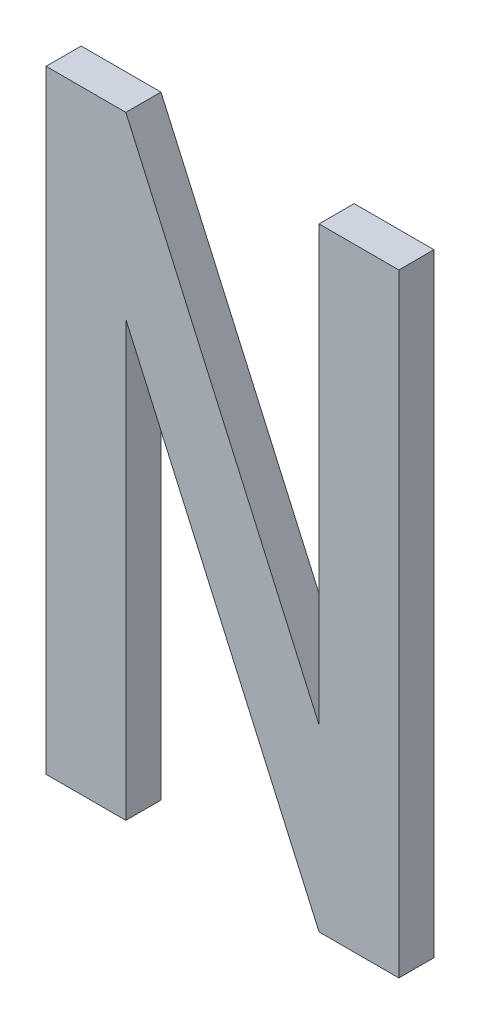
ISO-10303-21;
HEADER;
FILE_DESCRIPTION(('STEP AP214'),'2;1');
FILE_NAME('part.step','',(''),(''),'','','');
FILE_SCHEMA(('AUTOMOTIVE_DESIGN { 1 0 10303 214 1 1 1 1 }'));
ENDSEC;
DATA;
#1=APPLICATION_CONTEXT('core data for automotive mechanical design processes');
#2=APPLICATION_PROTOCOL_DEFINITION('international standard','automotive_design',2000,#1);
#3=PRODUCT_CONTEXT('',#1,'mechanical');
#4=PRODUCT('Part','Part','',(#3));
#5=PRODUCT_RELATED_PRODUCT_CATEGORY('part','',(#4));
#6=PRODUCT_DEFINITION_FORMATION('','',#4);
#7=PRODUCT_DEFINITION_CONTEXT('part definition',#1,'design');
#8=PRODUCT_DEFINITION('design','',#6,#7);
#9=PRODUCT_DEFINITION_SHAPE('','',#8);
#10=(LENGTH_UNIT() NAMED_UNIT(*) SI_UNIT(.MILLI.,.METRE.));
#11=(NAMED_UNIT(*) PLANE_ANGLE_UNIT() SI_UNIT($,.RADIAN.));
#12=(NAMED_UNIT(*) SI_UNIT($,.STERADIAN.) SOLID_ANGLE_UNIT());
#13=UNCERTAINTY_MEASURE_WITH_UNIT(LENGTH_MEASURE(1.E-05),#10,'distance_accuracy_value','');
#14=(GEOMETRIC_REPRESENTATION_CONTEXT(3) GLOBAL_UNCERTAINTY_ASSIGNED_CONTEXT((#13)) GLOBAL_UNIT_ASSIGNED_CONTEXT((#10,
#11,#12)) REPRESENTATION_CONTEXT('',''));
#15=CARTESIAN_POINT('',(0.,0.,0.));
#16=DIRECTION('',(0.,0.,1.));
#17=DIRECTION('',(1.,0.,0.));
#18=AXIS2_PLACEMENT_3D('',#15,#16,#17);
#19=CARTESIAN_POINT('',(-0.229064699613517,-0.0761015964274146,0.000499999999999999));
#20=DIRECTION('',(0.913553330450716,0.406718959998677,0.));
#21=DIRECTION('',(0.406718959998677,-0.913553330450716,0.));
#22=AXIS2_PLACEMENT_3D('',#19,#20,#21);
#23=PLANE('',#22);
#24=DIRECTION('',(0.,0.,1.));
#25=VECTOR('',#24,1.);
#26=CARTESIAN_POINT('',(-0.223560426585753,-0.0884650401091166,0.00025));
#27=LINE('',#26,#25);
#28=CARTESIAN_POINT('',(-0.223560426585753,-0.0884650401091163,-0.000499999999999999));
#29=VERTEX_POINT('',#28);
#30=CARTESIAN_POINT('',(-0.223560426585753,-0.0884650401091163,0.000499999999999999));
#31=VERTEX_POINT('',#30);
#32=EDGE_CURVE('E11',#29,#31,#27,.T.);
#33=ORIENTED_EDGE('',*,*,#32,.F.);
#34=DIRECTION('',(0.406718959998677,-0.913553330450716,0.));
#35=VECTOR('',#34,1.);
#36=CARTESIAN_POINT('',(-0.221286922509068,-0.0935716798906888,-0.000499999999999999));
#37=LINE('',#36,#35);
#38=CARTESIAN_POINT('',(-0.229064699613517,-0.0761015964274146,-0.000499999999999999));
#39=VERTEX_POINT('',#38);
#40=EDGE_CURVE('E24',#39,#29,#37,.T.);
#41=ORIENTED_EDGE('',*,*,#40,.F.);
#42=DIRECTION('',(0.,0.,1.));
#43=VECTOR('',#42,1.);
#44=CARTESIAN_POINT('',(-0.229064699613517,-0.0761015964274146,0.));
#45=LINE('',#44,#43);
#46=CARTESIAN_POINT('',(-0.229064699613517,-0.0761015964274146,0.000499999999999999));
#47=VERTEX_POINT('',#46);
#48=EDGE_CURVE('E175',#39,#47,#45,.T.);
#49=ORIENTED_EDGE('',*,*,#48,.T.);
#50=DIRECTION('',(-0.406718959998677,0.913553330450716,0.));
#51=VECTOR('',#50,1.);
#52=CARTESIAN_POINT('',(-0.221286922509068,-0.0935716798906888,0.000499999999999999));
#53=LINE('',#52,#51);
#54=EDGE_CURVE('E113',#31,#47,#53,.T.);
#55=ORIENTED_EDGE('',*,*,#54,.F.);
#56=EDGE_LOOP('',(#33,#41,#49,#55));
#57=FACE_BOUND('',#56,.T.);
#58=ADVANCED_FACE('F17',(#57),#23,.T.);
#59=CARTESIAN_POINT('',(-0.223560426585753,-0.0935716798906888,0.000499999999999999));
#60=DIRECTION('',(-0.913553330450716,-0.406718959998677,0.));
#61=DIRECTION('',(-0.406718959998677,0.913553330450716,0.));
#62=AXIS2_PLACEMENT_3D('',#59,#60,#61);
#63=PLANE('',#62);
#64=DIRECTION('',(0.,0.,1.));
#65=VECTOR('',#64,1.);
#66=CARTESIAN_POINT('',(-0.229064699613517,-0.0812082362089871,0.00025));
#67=LINE('',#66,#65);
#68=CARTESIAN_POINT('',(-0.229064699613517,-0.0812082362089871,-0.000499999999999999));
#69=VERTEX_POINT('',#68);
#70=CARTESIAN_POINT('',(-0.229064699613517,-0.0812082362089871,0.000499999999999999));
#71=VERTEX_POINT('',#70);
#72=EDGE_CURVE('E172',#69,#71,#67,.T.);
#73=ORIENTED_EDGE('',*,*,#72,.F.);
#74=DIRECTION('',(-0.406718959998677,0.913553330450716,0.));
#75=VECTOR('',#74,1.);
#76=CARTESIAN_POINT('',(-0.231338203690202,-0.0761015964274146,-0.000499999999999999));
#77=LINE('',#76,#75);
#78=CARTESIAN_POINT('',(-0.223560426585753,-0.0935716798906888,-0.000499999999999999));
#79=VERTEX_POINT('',#78);
#80=EDGE_CURVE('E169',#79,#69,#77,.T.);
#81=ORIENTED_EDGE('',*,*,#80,.F.);
#82=DIRECTION('',(0.,0.,1.));
#83=VECTOR('',#82,1.);
#84=CARTESIAN_POINT('',(-0.223560426585753,-0.0935716798906888,0.));
#85=LINE('',#84,#83);
#86=CARTESIAN_POINT('',(-0.223560426585753,-0.0935716798906888,0.000499999999999999));
#87=VERTEX_POINT('',#86);
#88=EDGE_CURVE('E167',#79,#87,#85,.T.);
#89=ORIENTED_EDGE('',*,*,#88,.T.);
#90=DIRECTION('',(0.406718959998677,-0.913553330450716,0.));
#91=VECTOR('',#90,1.);
#92=CARTESIAN_POINT('',(-0.231338203690202,-0.0761015964274146,0.000499999999999999));
#93=LINE('',#92,#91);
#94=EDGE_CURVE('E164',#71,#87,#93,.T.);
#95=ORIENTED_EDGE('',*,*,#94,.F.);
#96=EDGE_LOOP('',(#73,#81,#89,#95));
#97=FACE_BOUND('',#96,.T.);
#98=ADVANCED_FACE('F194',(#97),#63,.T.);
#99=CARTESIAN_POINT('',(-0.223560426585753,-0.0761015964274146,0.));
#100=DIRECTION('',(-1.,0.,0.));
#101=DIRECTION('',(0.,-1.,0.));
#102=AXIS2_PLACEMENT_3D('',#99,#100,#101);
#103=PLANE('',#102);
#104=ORIENTED_EDGE('',*,*,#32,.T.);
#105=DIRECTION('',(0.,-1.,0.));
#106=VECTOR('',#105,1.);
#107=CARTESIAN_POINT('',(-0.223560426585753,-0.0761015964274146,0.000499999999999999));
#108=LINE('',#107,#106);
#109=CARTESIAN_POINT('',(-0.223560426585753,-0.0761015964274146,0.000499999999999999));
#110=VERTEX_POINT('',#109);
#111=EDGE_CURVE('E162',#110,#31,#108,.T.);
#112=ORIENTED_EDGE('',*,*,#111,.F.);
#113=DIRECTION('',(0.,0.,1.));
#114=VECTOR('',#113,1.);
#115=CARTESIAN_POINT('',(-0.223560426585753,-0.0761015964274146,0.));
#116=LINE('',#115,#114);
#117=CARTESIAN_POINT('',(-0.223560426585753,-0.0761015964274146,-0.000499999999999999));
#118=VERTEX_POINT('',#117);
#119=EDGE_CURVE('E159',#118,#110,#116,.T.);
#120=ORIENTED_EDGE('',*,*,#119,.F.);
#121=DIRECTION('',(0.,1.,0.));
#122=VECTOR('',#121,1.);
#123=CARTESIAN_POINT('',(-0.223560426585753,-0.0761015964274146,-0.000499999999999999));
#124=LINE('',#123,#122);
#125=EDGE_CURVE('E156',#29,#118,#124,.T.);
#126=ORIENTED_EDGE('',*,*,#125,.F.);
#127=EDGE_LOOP('',(#104,#112,#120,#126));
#128=FACE_BOUND('',#127,.T.);
#129=ADVANCED_FACE('F179',(#128),#103,.T.);
#130=CARTESIAN_POINT('',(-0.223560426585753,-0.0935716798906888,0.));
#131=DIRECTION('',(0.,-1.,0.));
#132=DIRECTION('',(1.,0.,0.));
#133=AXIS2_PLACEMENT_3D('',#130,#131,#132);
#134=PLANE('',#133);
#135=DIRECTION('',(0.,0.,-1.));
#136=VECTOR('',#135,1.);
#137=CARTESIAN_POINT('',(-0.221286922509068,-0.0935716798906888,0.));
#138=LINE('',#137,#136);
#139=CARTESIAN_POINT('',(-0.221286922509068,-0.0935716798906888,0.000499999999999999));
#140=VERTEX_POINT('',#139);
#141=CARTESIAN_POINT('',(-0.221286922509068,-0.0935716798906888,-0.000499999999999999));
#142=VERTEX_POINT('',#141);
#143=EDGE_CURVE('E154',#140,#142,#138,.T.);
#144=ORIENTED_EDGE('',*,*,#143,.F.);
#145=DIRECTION('',(1.,0.,0.));
#146=VECTOR('',#145,1.);
#147=CARTESIAN_POINT('',(-0.223560426585753,-0.0935716798906888,0.000499999999999999));
#148=LINE('',#147,#146);
#149=EDGE_CURVE('E151',#87,#140,#148,.T.);
#150=ORIENTED_EDGE('',*,*,#149,.F.);
#151=ORIENTED_EDGE('',*,*,#88,.F.);
#152=DIRECTION('',(-1.,0.,0.));
#153=VECTOR('',#152,1.);
#154=CARTESIAN_POINT('',(-0.223560426585753,-0.0935716798906888,-0.000499999999999999));
#155=LINE('',#154,#153);
#156=EDGE_CURVE('E148',#142,#79,#155,.T.);
#157=ORIENTED_EDGE('',*,*,#156,.F.);
#158=EDGE_LOOP('',(#144,#150,#151,#157));
#159=FACE_BOUND('',#158,.T.);
#160=ADVANCED_FACE('F191',(#159),#134,.T.);
#161=CARTESIAN_POINT('',(-0.221286922509068,-0.0761015964274146,0.));
#162=DIRECTION('',(0.,1.,0.));
#163=DIRECTION('',(-1.,0.,0.));
#164=AXIS2_PLACEMENT_3D('',#161,#162,#163);
#165=PLANE('',#164);
#166=ORIENTED_EDGE('',*,*,#119,.T.);
#167=DIRECTION('',(-1.,0.,0.));
#168=VECTOR('',#167,1.);
#169=CARTESIAN_POINT('',(-0.221286922509068,-0.0761015964274146,0.000499999999999999));
#170=LINE('',#169,#168);
#171=CARTESIAN_POINT('',(-0.221286922509068,-0.0761015964274146,0.000499999999999999));
#172=VERTEX_POINT('',#171);
#173=EDGE_CURVE('E145',#172,#110,#170,.T.);
#174=ORIENTED_EDGE('',*,*,#173,.F.);
#175=DIRECTION('',(0.,0.,1.));
#176=VECTOR('',#175,1.);
#177=CARTESIAN_POINT('',(-0.221286922509068,-0.0761015964274146,0.));
#178=LINE('',#177,#176);
#179=CARTESIAN_POINT('',(-0.221286922509068,-0.0761015964274146,-0.000499999999999999));
#180=VERTEX_POINT('',#179);
#181=EDGE_CURVE('E142',#180,#172,#178,.T.);
#182=ORIENTED_EDGE('',*,*,#181,.F.);
#183=DIRECTION('',(1.,0.,0.));
#184=VECTOR('',#183,1.);
#185=CARTESIAN_POINT('',(-0.221286922509068,-0.0761015964274146,-0.000499999999999999));
#186=LINE('',#185,#184);
#187=EDGE_CURVE('E139',#118,#180,#186,.T.);
#188=ORIENTED_EDGE('',*,*,#187,.F.);
#189=EDGE_LOOP('',(#166,#174,#182,#188));
#190=FACE_BOUND('',#189,.T.);
#191=ADVANCED_FACE('F181',(#190),#165,.T.);
#192=CARTESIAN_POINT('',(-0.221286922509068,-0.0935716798906888,0.));
#193=DIRECTION('',(1.,0.,0.));
#194=DIRECTION('',(0.,1.,0.));
#195=AXIS2_PLACEMENT_3D('',#192,#193,#194);
#196=PLANE('',#195);
#197=ORIENTED_EDGE('',*,*,#181,.T.);
#198=DIRECTION('',(0.,1.,0.));
#199=VECTOR('',#198,1.);
#200=CARTESIAN_POINT('',(-0.221286922509068,-0.0935716798906888,0.000499999999999999));
#201=LINE('',#200,#199);
#202=EDGE_CURVE('E136',#140,#172,#201,.T.);
#203=ORIENTED_EDGE('',*,*,#202,.F.);
#204=ORIENTED_EDGE('',*,*,#143,.T.);
#205=DIRECTION('',(0.,-1.,0.));
#206=VECTOR('',#205,1.);
#207=CARTESIAN_POINT('',(-0.221286922509068,-0.0935716798906888,-0.000499999999999999));
#208=LINE('',#207,#206);
#209=EDGE_CURVE('E133',#180,#142,#208,.T.);
#210=ORIENTED_EDGE('',*,*,#209,.F.);
#211=EDGE_LOOP('',(#197,#203,#204,#210));
#212=FACE_BOUND('',#211,.T.);
#213=ADVANCED_FACE('F185',(#212),#196,.T.);
#214=CARTESIAN_POINT('',(-0.229064699613517,-0.0935716798906888,0.));
#215=DIRECTION('',(1.,0.,0.));
#216=DIRECTION('',(0.,1.,0.));
#217=AXIS2_PLACEMENT_3D('',#214,#215,#216);
#218=PLANE('',#217);
#219=ORIENTED_EDGE('',*,*,#72,.T.);
#220=DIRECTION('',(0.,1.,0.));
#221=VECTOR('',#220,1.);
#222=CARTESIAN_POINT('',(-0.229064699613517,-0.0935716798906888,0.000499999999999999));
#223=LINE('',#222,#221);
#224=CARTESIAN_POINT('',(-0.229064699613517,-0.0935716798906888,0.000499999999999999));
#225=VERTEX_POINT('',#224);
#226=EDGE_CURVE('E130',#225,#71,#223,.T.);
#227=ORIENTED_EDGE('',*,*,#226,.F.);
#228=DIRECTION('',(0.,0.,1.));
#229=VECTOR('',#228,1.);
#230=CARTESIAN_POINT('',(-0.229064699613517,-0.0935716798906888,0.));
#231=LINE('',#230,#229);
#232=CARTESIAN_POINT('',(-0.229064699613517,-0.0935716798906888,-0.000499999999999999));
#233=VERTEX_POINT('',#232);
#234=EDGE_CURVE('E127',#233,#225,#231,.T.);
#235=ORIENTED_EDGE('',*,*,#234,.F.);
#236=DIRECTION('',(0.,-1.,0.));
#237=VECTOR('',#236,1.);
#238=CARTESIAN_POINT('',(-0.229064699613517,-0.0935716798906888,-0.000499999999999999));
#239=LINE('',#238,#237);
#240=EDGE_CURVE('E124',#69,#233,#239,.T.);
#241=ORIENTED_EDGE('',*,*,#240,.F.);
#242=EDGE_LOOP('',(#219,#227,#235,#241));
#243=FACE_BOUND('',#242,.T.);
#244=ADVANCED_FACE('F196',(#243),#218,.T.);
#245=CARTESIAN_POINT('',(-0.23020145165186,-0.0848366381590519,-0.000499999999999999));
#246=DIRECTION('',(0.,0.,-1.));
#247=DIRECTION('',(-1.,0.,0.));
#248=AXIS2_PLACEMENT_3D('',#245,#246,#247);
#249=PLANE('',#248);
#250=ORIENTED_EDGE('',*,*,#240,.T.);
#251=DIRECTION('',(-1.,0.,0.));
#252=VECTOR('',#251,1.);
#253=CARTESIAN_POINT('',(-0.231338203690202,-0.0935716798906888,-0.000499999999999999));
#254=LINE('',#253,#252);
#255=CARTESIAN_POINT('',(-0.231338203690202,-0.0935716798906888,-0.000499999999999999));
#256=VERTEX_POINT('',#255);
#257=EDGE_CURVE('E122',#233,#256,#254,.T.);
#258=ORIENTED_EDGE('',*,*,#257,.T.);
#259=DIRECTION('',(0.,1.,0.));
#260=VECTOR('',#259,1.);
#261=CARTESIAN_POINT('',(-0.231338203690202,-0.0761015964274146,-0.000499999999999999));
#262=LINE('',#261,#260);
#263=CARTESIAN_POINT('',(-0.231338203690202,-0.0761015964274146,-0.000499999999999999));
#264=VERTEX_POINT('',#263);
#265=EDGE_CURVE('E120',#256,#264,#262,.T.);
#266=ORIENTED_EDGE('',*,*,#265,.T.);
#267=DIRECTION('',(1.,0.,0.));
#268=VECTOR('',#267,1.);
#269=CARTESIAN_POINT('',(-0.229064699613517,-0.0761015964274146,-0.000499999999999999));
#270=LINE('',#269,#268);
#271=EDGE_CURVE('E108',#264,#39,#270,.T.);
#272=ORIENTED_EDGE('',*,*,#271,.T.);
#273=ORIENTED_EDGE('',*,*,#40,.T.);
#274=ORIENTED_EDGE('',*,*,#125,.T.);
#275=ORIENTED_EDGE('',*,*,#187,.T.);
#276=ORIENTED_EDGE('',*,*,#209,.T.);
#277=ORIENTED_EDGE('',*,*,#156,.T.);
#278=ORIENTED_EDGE('',*,*,#80,.T.);
#279=EDGE_LOOP('',(#250,#258,#266,#272,#273,#274,#275,#276,#277,#278));
#280=FACE_BOUND('',#279,.T.);
#281=ADVANCED_FACE('F177',(#280),#249,.T.);
#282=CARTESIAN_POINT('',(-0.231338203690202,-0.0761015964274146,0.));
#283=DIRECTION('',(-1.,0.,0.));
#284=DIRECTION('',(0.,-1.,0.));
#285=AXIS2_PLACEMENT_3D('',#282,#283,#284);
#286=PLANE('',#285);
#287=DIRECTION('',(0.,0.,-1.));
#288=VECTOR('',#287,1.);
#289=CARTESIAN_POINT('',(-0.231338203690202,-0.0935716798906888,0.));
#290=LINE('',#289,#288);
#291=CARTESIAN_POINT('',(-0.231338203690202,-0.0935716798906888,0.000499999999999999));
#292=VERTEX_POINT('',#291);
#293=EDGE_CURVE('E95',#292,#256,#290,.T.);
#294=ORIENTED_EDGE('',*,*,#293,.F.);
#295=DIRECTION('',(0.,-1.,0.));
#296=VECTOR('',#295,1.);
#297=CARTESIAN_POINT('',(-0.231338203690202,-0.0761015964274146,0.000499999999999999));
#298=LINE('',#297,#296);
#299=CARTESIAN_POINT('',(-0.231338203690202,-0.0761015964274146,0.000499999999999999));
#300=VERTEX_POINT('',#299);
#301=EDGE_CURVE('E89',#300,#292,#298,.T.);
#302=ORIENTED_EDGE('',*,*,#301,.F.);
#303=DIRECTION('',(0.,0.,1.));
#304=VECTOR('',#303,1.);
#305=CARTESIAN_POINT('',(-0.231338203690202,-0.0761015964274146,0.));
#306=LINE('',#305,#304);
#307=EDGE_CURVE('E93',#264,#300,#306,.T.);
#308=ORIENTED_EDGE('',*,*,#307,.F.);
#309=ORIENTED_EDGE('',*,*,#265,.F.);
#310=EDGE_LOOP('',(#294,#302,#308,#309));
#311=FACE_BOUND('',#310,.T.);
#312=ADVANCED_FACE('F91',(#311),#286,.T.);
#313=CARTESIAN_POINT('',(-0.229064699613517,-0.0761015964274146,0.));
#314=DIRECTION('',(0.,1.,0.));
#315=DIRECTION('',(-1.,0.,0.));
#316=AXIS2_PLACEMENT_3D('',#313,#314,#315);
#317=PLANE('',#316);
#318=ORIENTED_EDGE('',*,*,#307,.T.);
#319=DIRECTION('',(-1.,0.,0.));
#320=VECTOR('',#319,1.);
#321=CARTESIAN_POINT('',(-0.229064699613517,-0.0761015964274146,0.000499999999999999));
#322=LINE('',#321,#320);
#323=EDGE_CURVE('E106',#47,#300,#322,.T.);
#324=ORIENTED_EDGE('',*,*,#323,.F.);
#325=ORIENTED_EDGE('',*,*,#48,.F.);
#326=ORIENTED_EDGE('',*,*,#271,.F.);
#327=EDGE_LOOP('',(#318,#324,#325,#326));
#328=FACE_BOUND('',#327,.T.);
#329=ADVANCED_FACE('F104',(#328),#317,.T.);
#330=CARTESIAN_POINT('',(-0.231338203690202,-0.0935716798906888,0.));
#331=DIRECTION('',(0.,-1.,0.));
#332=DIRECTION('',(1.,0.,0.));
#333=AXIS2_PLACEMENT_3D('',#330,#331,#332);
#334=PLANE('',#333);
#335=ORIENTED_EDGE('',*,*,#234,.T.);
#336=DIRECTION('',(1.,0.,0.));
#337=VECTOR('',#336,1.);
#338=CARTESIAN_POINT('',(-0.231338203690202,-0.0935716798906888,0.000499999999999999));
#339=LINE('',#338,#337);
#340=EDGE_CURVE('E114',#292,#225,#339,.T.);
#341=ORIENTED_EDGE('',*,*,#340,.F.);
#342=ORIENTED_EDGE('',*,*,#293,.T.);
#343=ORIENTED_EDGE('',*,*,#257,.F.);
#344=EDGE_LOOP('',(#335,#341,#342,#343));
#345=FACE_BOUND('',#344,.T.);
#346=ADVANCED_FACE('F199',(#345),#334,.T.);
#347=CARTESIAN_POINT('',(-0.23020145165186,-0.0848366381590519,0.000499999999999999));
#348=DIRECTION('',(0.,0.,1.));
#349=DIRECTION('',(1.,0.,0.));
#350=AXIS2_PLACEMENT_3D('',#347,#348,#349);
#351=PLANE('',#350);
#352=ORIENTED_EDGE('',*,*,#301,.T.);
#353=ORIENTED_EDGE('',*,*,#340,.T.);
#354=ORIENTED_EDGE('',*,*,#226,.T.);
#355=ORIENTED_EDGE('',*,*,#94,.T.);
#356=ORIENTED_EDGE('',*,*,#149,.T.);
#357=ORIENTED_EDGE('',*,*,#202,.T.);
#358=ORIENTED_EDGE('',*,*,#173,.T.);
#359=ORIENTED_EDGE('',*,*,#111,.T.);
#360=ORIENTED_EDGE('',*,*,#54,.T.);
#361=ORIENTED_EDGE('',*,*,#323,.T.);
#362=EDGE_LOOP('',(#352,#353,#354,#355,#356,#357,#358,#359,#360,#361));
#363=FACE_BOUND('',#362,.T.);
#364=ADVANCED_FACE('F111',(#363),#351,.T.);
#365=CLOSED_SHELL('',(#58,#98,#129,#160,#191,#213,#244,#281,#312,#329,#346,#364));
#366=MANIFOLD_SOLID_BREP('B1',#365);
#367=ADVANCED_BREP_SHAPE_REPRESENTATION('',(#18,#366),#14);
#368=SHAPE_DEFINITION_REPRESENTATION(#9,#367);
ENDSEC;
END-ISO-10303-21;
